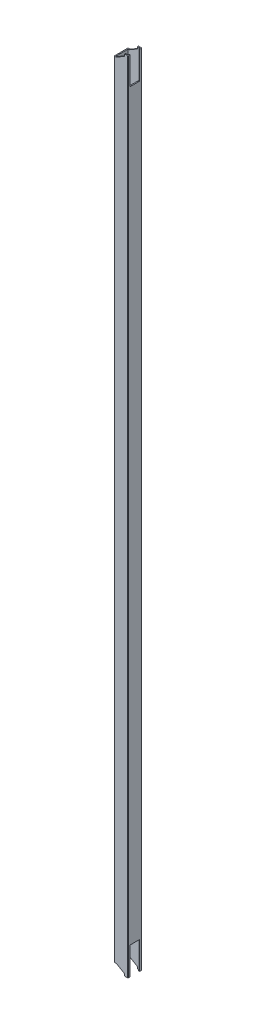
ISO-10303-21;
HEADER;
FILE_DESCRIPTION(('STEP AP214'),'2;1');
FILE_NAME('part.step','',(''),(''),'','','');
FILE_SCHEMA(('AUTOMOTIVE_DESIGN { 1 0 10303 214 1 1 1 1 }'));
ENDSEC;
DATA;
#1=APPLICATION_CONTEXT('core data for automotive mechanical design processes');
#2=APPLICATION_PROTOCOL_DEFINITION('international standard','automotive_design',2000,#1);
#3=PRODUCT_CONTEXT('',#1,'mechanical');
#4=PRODUCT('Part','Part','',(#3));
#5=PRODUCT_RELATED_PRODUCT_CATEGORY('part','',(#4));
#6=PRODUCT_DEFINITION_FORMATION('','',#4);
#7=PRODUCT_DEFINITION_CONTEXT('part definition',#1,'design');
#8=PRODUCT_DEFINITION('design','',#6,#7);
#9=PRODUCT_DEFINITION_SHAPE('','',#8);
#10=(LENGTH_UNIT() NAMED_UNIT(*) SI_UNIT(.MILLI.,.METRE.));
#11=(NAMED_UNIT(*) PLANE_ANGLE_UNIT() SI_UNIT($,.RADIAN.));
#12=(NAMED_UNIT(*) SI_UNIT($,.STERADIAN.) SOLID_ANGLE_UNIT());
#13=UNCERTAINTY_MEASURE_WITH_UNIT(LENGTH_MEASURE(1.E-05),#10,'distance_accuracy_value','');
#14=(GEOMETRIC_REPRESENTATION_CONTEXT(3) GLOBAL_UNCERTAINTY_ASSIGNED_CONTEXT((#13)) GLOBAL_UNIT_ASSIGNED_CONTEXT((#10,
#11,#12)) REPRESENTATION_CONTEXT('',''));
#15=CARTESIAN_POINT('',(0.,0.,0.));
#16=DIRECTION('',(0.,0.,1.));
#17=DIRECTION('',(1.,0.,0.));
#18=AXIS2_PLACEMENT_3D('',#15,#16,#17);
#19=CARTESIAN_POINT('',(19.5,0.,-0.5));
#20=DIRECTION('',(0.,1.,0.));
#21=DIRECTION('',(0.,0.,1.));
#22=AXIS2_PLACEMENT_3D('',#19,#20,#21);
#23=PLANE('',#22);
#24=DIRECTION('',(0.,0.,-1.));
#25=VECTOR('',#24,1.);
#26=CARTESIAN_POINT('',(15.,0.,0.));
#27=LINE('',#26,#25);
#28=CARTESIAN_POINT('',(15.,0.,-18.5));
#29=VERTEX_POINT('',#28);
#30=CARTESIAN_POINT('',(15.,0.,-20.));
#31=VERTEX_POINT('',#30);
#32=EDGE_CURVE('E284',#29,#31,#27,.T.);
#33=ORIENTED_EDGE('',*,*,#32,.T.);
#34=DIRECTION('',(-1.,0.,0.));
#35=VECTOR('',#34,1.);
#36=CARTESIAN_POINT('',(0.5,0.,-20.));
#37=LINE('',#36,#35);
#38=CARTESIAN_POINT('',(19.5,0.,-20.));
#39=VERTEX_POINT('',#38);
#40=EDGE_CURVE('E431',#39,#31,#37,.T.);
#41=ORIENTED_EDGE('',*,*,#40,.F.);
#42=CARTESIAN_POINT('',(19.5,0.,-19.5));
#43=DIRECTION('',(0.,1.,0.));
#44=DIRECTION('',(0.,0.,-1.));
#45=AXIS2_PLACEMENT_3D('',#42,#43,#44);
#46=CIRCLE('',#45,0.5);
#47=CARTESIAN_POINT('',(20.,0.,-19.5));
#48=VERTEX_POINT('',#47);
#49=EDGE_CURVE('E429',#48,#39,#46,.T.);
#50=ORIENTED_EDGE('',*,*,#49,.F.);
#51=DIRECTION('',(0.,0.,-1.));
#52=VECTOR('',#51,1.);
#53=CARTESIAN_POINT('',(20.,0.,-0.5));
#54=LINE('',#53,#52);
#55=CARTESIAN_POINT('',(20.,0.,-17.));
#56=VERTEX_POINT('',#55);
#57=EDGE_CURVE('E425',#56,#48,#54,.T.);
#58=ORIENTED_EDGE('',*,*,#57,.F.);
#59=DIRECTION('',(-1.,0.,0.));
#60=VECTOR('',#59,1.);
#61=CARTESIAN_POINT('',(19.5,0.,-17.));
#62=LINE('',#61,#60);
#63=CARTESIAN_POINT('',(18.5,0.,-17.));
#64=VERTEX_POINT('',#63);
#65=EDGE_CURVE('E474',#56,#64,#62,.T.);
#66=ORIENTED_EDGE('',*,*,#65,.T.);
#67=DIRECTION('',(0.,0.,-1.));
#68=VECTOR('',#67,1.);
#69=CARTESIAN_POINT('',(18.5,0.,-1.5));
#70=LINE('',#69,#68);
#71=CARTESIAN_POINT('',(18.5,0.,-18.5));
#72=VERTEX_POINT('',#71);
#73=EDGE_CURVE('E389',#64,#72,#70,.T.);
#74=ORIENTED_EDGE('',*,*,#73,.T.);
#75=DIRECTION('',(-1.,0.,0.));
#76=VECTOR('',#75,1.);
#77=CARTESIAN_POINT('',(1.5,0.,-18.5));
#78=LINE('',#77,#76);
#79=EDGE_CURVE('E380',#72,#29,#78,.T.);
#80=ORIENTED_EDGE('',*,*,#79,.T.);
#81=EDGE_LOOP('',(#33,#41,#50,#58,#66,#74,#80));
#82=FACE_BOUND('',#81,.T.);
#83=ADVANCED_FACE('F33',(#82),#23,.F.);
#84=CARTESIAN_POINT('',(15.,0.,0.));
#85=VERTEX_POINT('',#84);
#86=CARTESIAN_POINT('',(15.,0.,-1.5));
#87=VERTEX_POINT('',#86);
#88=EDGE_CURVE('E280',#85,#87,#27,.T.);
#89=ORIENTED_EDGE('',*,*,#88,.T.);
#90=DIRECTION('',(1.,0.,0.));
#91=VECTOR('',#90,1.);
#92=CARTESIAN_POINT('',(1.5,0.,-1.5));
#93=LINE('',#92,#91);
#94=CARTESIAN_POINT('',(18.5,0.,-1.5));
#95=VERTEX_POINT('',#94);
#96=EDGE_CURVE('E376',#87,#95,#93,.T.);
#97=ORIENTED_EDGE('',*,*,#96,.T.);
#98=CARTESIAN_POINT('',(18.5,0.,-3.));
#99=VERTEX_POINT('',#98);
#100=EDGE_CURVE('E390',#95,#99,#70,.T.);
#101=ORIENTED_EDGE('',*,*,#100,.T.);
#102=DIRECTION('',(1.,0.,0.));
#103=VECTOR('',#102,1.);
#104=CARTESIAN_POINT('',(19.5,0.,-3.));
#105=LINE('',#104,#103);
#106=CARTESIAN_POINT('',(20.,0.,-2.99999999999999));
#107=VERTEX_POINT('',#106);
#108=EDGE_CURVE('E472',#99,#107,#105,.T.);
#109=ORIENTED_EDGE('',*,*,#108,.T.);
#110=CARTESIAN_POINT('',(20.,0.,-0.5));
#111=VERTEX_POINT('',#110);
#112=EDGE_CURVE('E426',#111,#107,#54,.T.);
#113=ORIENTED_EDGE('',*,*,#112,.F.);
#114=CARTESIAN_POINT('',(19.5,0.,-0.5));
#115=DIRECTION('',(0.,1.,0.));
#116=DIRECTION('',(0.,0.,1.));
#117=AXIS2_PLACEMENT_3D('',#114,#115,#116);
#118=CIRCLE('',#117,0.5);
#119=CARTESIAN_POINT('',(19.5,0.,0.));
#120=VERTEX_POINT('',#119);
#121=EDGE_CURVE('E406',#120,#111,#118,.T.);
#122=ORIENTED_EDGE('',*,*,#121,.F.);
#123=DIRECTION('',(1.,0.,0.));
#124=VECTOR('',#123,1.);
#125=CARTESIAN_POINT('',(0.500000000000004,0.,0.));
#126=LINE('',#125,#124);
#127=EDGE_CURVE('E411',#85,#120,#126,.T.);
#128=ORIENTED_EDGE('',*,*,#127,.F.);
#129=EDGE_LOOP('',(#89,#97,#101,#109,#113,#122,#128));
#130=FACE_BOUND('',#129,.T.);
#131=ADVANCED_FACE('F552',(#130),#23,.F.);
#132=CARTESIAN_POINT('',(0.5,1156.4,-20.));
#133=DIRECTION('',(0.,0.,1.));
#134=DIRECTION('',(1.,0.,0.));
#135=AXIS2_PLACEMENT_3D('',#132,#133,#134);
#136=PLANE('',#135);
#137=DIRECTION('',(0.,1.,0.));
#138=VECTOR('',#137,1.);
#139=CARTESIAN_POINT('',(15.,0.,-20.));
#140=LINE('',#139,#138);
#141=CARTESIAN_POINT('',(15.,2.99999999999989,-20.));
#142=VERTEX_POINT('',#141);
#143=EDGE_CURVE('E267',#31,#142,#140,.T.);
#144=ORIENTED_EDGE('',*,*,#143,.T.);
#145=DIRECTION('',(-0.86377890089843,0.503871025524092,0.));
#146=VECTOR('',#145,1.);
#147=CARTESIAN_POINT('',(15.,2.99999999999989,-20.));
#148=LINE('',#147,#146);
#149=CARTESIAN_POINT('',(3.,10.,-20.));
#150=VERTEX_POINT('',#149);
#151=EDGE_CURVE('E270',#142,#150,#148,.T.);
#152=ORIENTED_EDGE('',*,*,#151,.T.);
#153=DIRECTION('',(-1.,0.,0.));
#154=VECTOR('',#153,1.);
#155=CARTESIAN_POINT('',(3.,10.,-20.));
#156=LINE('',#155,#154);
#157=CARTESIAN_POINT('',(0.5,10.,-20.));
#158=VERTEX_POINT('',#157);
#159=EDGE_CURVE('E275',#150,#158,#156,.T.);
#160=ORIENTED_EDGE('',*,*,#159,.T.);
#161=DIRECTION('',(0.,-1.,0.));
#162=VECTOR('',#161,1.);
#163=CARTESIAN_POINT('',(0.5,1156.4,-20.));
#164=LINE('',#163,#162);
#165=CARTESIAN_POINT('',(0.5,1146.4,-20.));
#166=VERTEX_POINT('',#165);
#167=EDGE_CURVE('E444',#166,#158,#164,.T.);
#168=ORIENTED_EDGE('',*,*,#167,.F.);
#169=DIRECTION('',(-1.,0.,0.));
#170=VECTOR('',#169,1.);
#171=CARTESIAN_POINT('',(3.,1146.4,-20.));
#172=LINE('',#171,#170);
#173=CARTESIAN_POINT('',(3.,1146.4,-20.));
#174=VERTEX_POINT('',#173);
#175=EDGE_CURVE('E319',#174,#166,#172,.T.);
#176=ORIENTED_EDGE('',*,*,#175,.F.);
#177=DIRECTION('',(-0.86377890089843,-0.503871025524092,0.));
#178=VECTOR('',#177,1.);
#179=CARTESIAN_POINT('',(15.,1153.4,-20.));
#180=LINE('',#179,#178);
#181=CARTESIAN_POINT('',(15.,1153.4,-20.));
#182=VERTEX_POINT('',#181);
#183=EDGE_CURVE('E327',#182,#174,#180,.T.);
#184=ORIENTED_EDGE('',*,*,#183,.F.);
#185=DIRECTION('',(0.,-1.,0.));
#186=VECTOR('',#185,1.);
#187=CARTESIAN_POINT('',(15.,1156.4,-20.));
#188=LINE('',#187,#186);
#189=CARTESIAN_POINT('',(15.,1156.4,-20.));
#190=VERTEX_POINT('',#189);
#191=EDGE_CURVE('E314',#190,#182,#188,.T.);
#192=ORIENTED_EDGE('',*,*,#191,.F.);
#193=DIRECTION('',(-1.,0.,0.));
#194=VECTOR('',#193,1.);
#195=CARTESIAN_POINT('',(0.5,1156.4,-20.));
#196=LINE('',#195,#194);
#197=CARTESIAN_POINT('',(19.5,1156.4,-20.));
#198=VERTEX_POINT('',#197);
#199=EDGE_CURVE('E417',#198,#190,#196,.T.);
#200=ORIENTED_EDGE('',*,*,#199,.F.);
#201=DIRECTION('',(0.,-1.,0.));
#202=VECTOR('',#201,1.);
#203=CARTESIAN_POINT('',(19.5,1156.4,-20.));
#204=LINE('',#203,#202);
#205=EDGE_CURVE('E447',#198,#39,#204,.T.);
#206=ORIENTED_EDGE('',*,*,#205,.T.);
#207=ORIENTED_EDGE('',*,*,#40,.T.);
#208=EDGE_LOOP('',(#144,#152,#160,#168,#176,#184,#192,#200,#206,#207));
#209=FACE_BOUND('',#208,.T.);
#210=ADVANCED_FACE('F496',(#209),#136,.F.);
#211=CARTESIAN_POINT('',(0.5,1156.4,-19.5));
#212=DIRECTION('',(0.,-1.,0.));
#213=DIRECTION('',(0.,0.,-1.));
#214=AXIS2_PLACEMENT_3D('',#211,#212,#213);
#215=CYLINDRICAL_SURFACE('',#214,0.5);
#216=CARTESIAN_POINT('',(0.5,10.,-19.5));
#217=DIRECTION('',(0.,-1.,0.));
#218=DIRECTION('',(0.,0.,-1.));
#219=AXIS2_PLACEMENT_3D('',#216,#217,#218);
#220=CIRCLE('',#219,0.5);
#221=CARTESIAN_POINT('',(0.,10.,-19.5));
#222=VERTEX_POINT('',#221);
#223=EDGE_CURVE('E292',#222,#158,#220,.T.);
#224=ORIENTED_EDGE('',*,*,#223,.F.);
#225=DIRECTION('',(0.,-1.,0.));
#226=VECTOR('',#225,1.);
#227=CARTESIAN_POINT('',(0.,1156.4,-19.5));
#228=LINE('',#227,#226);
#229=CARTESIAN_POINT('',(0.,1146.4,-19.5));
#230=VERTEX_POINT('',#229);
#231=EDGE_CURVE('E441',#230,#222,#228,.T.);
#232=ORIENTED_EDGE('',*,*,#231,.F.);
#233=CARTESIAN_POINT('',(0.5,1146.4,-19.5));
#234=DIRECTION('',(0.,-1.,0.));
#235=DIRECTION('',(0.,0.,-1.));
#236=AXIS2_PLACEMENT_3D('',#233,#234,#235);
#237=CIRCLE('',#236,0.5);
#238=EDGE_CURVE('E355',#230,#166,#237,.T.);
#239=ORIENTED_EDGE('',*,*,#238,.T.);
#240=ORIENTED_EDGE('',*,*,#167,.T.);
#241=EDGE_LOOP('',(#224,#232,#239,#240));
#242=FACE_BOUND('',#241,.T.);
#243=ADVANCED_FACE('F581',(#242),#215,.T.);
#244=CARTESIAN_POINT('',(0.,1156.4,-0.500000000000004));
#245=DIRECTION('',(1.,0.,0.));
#246=DIRECTION('',(0.,0.,-1.));
#247=AXIS2_PLACEMENT_3D('',#244,#245,#246);
#248=PLANE('',#247);
#249=DIRECTION('',(0.,0.,-1.));
#250=VECTOR('',#249,1.);
#251=CARTESIAN_POINT('',(0.,10.,0.));
#252=LINE('',#251,#250);
#253=CARTESIAN_POINT('',(0.,10.,-0.5));
#254=VERTEX_POINT('',#253);
#255=EDGE_CURVE('E274',#254,#222,#252,.T.);
#256=ORIENTED_EDGE('',*,*,#255,.F.);
#257=DIRECTION('',(0.,-1.,0.));
#258=VECTOR('',#257,1.);
#259=CARTESIAN_POINT('',(0.,1156.4,-0.500000000000003));
#260=LINE('',#259,#258);
#261=CARTESIAN_POINT('',(0.,1146.4,-0.5));
#262=VERTEX_POINT('',#261);
#263=EDGE_CURVE('E438',#262,#254,#260,.T.);
#264=ORIENTED_EDGE('',*,*,#263,.F.);
#265=DIRECTION('',(0.,0.,-1.));
#266=VECTOR('',#265,1.);
#267=CARTESIAN_POINT('',(0.,1146.4,0.));
#268=LINE('',#267,#266);
#269=EDGE_CURVE('E331',#262,#230,#268,.T.);
#270=ORIENTED_EDGE('',*,*,#269,.T.);
#271=ORIENTED_EDGE('',*,*,#231,.T.);
#272=EDGE_LOOP('',(#256,#264,#270,#271));
#273=FACE_BOUND('',#272,.T.);
#274=ADVANCED_FACE('F578',(#273),#248,.F.);
#275=CARTESIAN_POINT('',(0.5,1156.4,-0.5));
#276=DIRECTION('',(0.,-1.,0.));
#277=DIRECTION('',(0.,0.,-1.));
#278=AXIS2_PLACEMENT_3D('',#275,#276,#277);
#279=CYLINDRICAL_SURFACE('',#278,0.5);
#280=CARTESIAN_POINT('',(0.5,10.,-0.5));
#281=DIRECTION('',(0.,-1.,0.));
#282=DIRECTION('',(0.,0.,-1.));
#283=AXIS2_PLACEMENT_3D('',#280,#281,#282);
#284=CIRCLE('',#283,0.5);
#285=CARTESIAN_POINT('',(0.500000000000003,10.,0.));
#286=VERTEX_POINT('',#285);
#287=EDGE_CURVE('E290',#286,#254,#284,.T.);
#288=ORIENTED_EDGE('',*,*,#287,.F.);
#289=DIRECTION('',(0.,-1.,0.));
#290=VECTOR('',#289,1.);
#291=CARTESIAN_POINT('',(0.500000000000004,1156.4,0.));
#292=LINE('',#291,#290);
#293=CARTESIAN_POINT('',(0.500000000000003,1146.4,0.));
#294=VERTEX_POINT('',#293);
#295=EDGE_CURVE('E266',#294,#286,#292,.T.);
#296=ORIENTED_EDGE('',*,*,#295,.F.);
#297=CARTESIAN_POINT('',(0.5,1146.4,-0.5));
#298=DIRECTION('',(0.,-1.,0.));
#299=DIRECTION('',(0.,0.,-1.));
#300=AXIS2_PLACEMENT_3D('',#297,#298,#299);
#301=CIRCLE('',#300,0.5);
#302=EDGE_CURVE('E352',#294,#262,#301,.T.);
#303=ORIENTED_EDGE('',*,*,#302,.T.);
#304=ORIENTED_EDGE('',*,*,#263,.T.);
#305=EDGE_LOOP('',(#288,#296,#303,#304));
#306=FACE_BOUND('',#305,.T.);
#307=ADVANCED_FACE('F573',(#306),#279,.T.);
#308=CARTESIAN_POINT('',(0.500000000000004,1156.4,0.));
#309=DIRECTION('',(0.,0.,-1.));
#310=DIRECTION('',(-1.,0.,0.));
#311=AXIS2_PLACEMENT_3D('',#308,#309,#310);
#312=PLANE('',#311);
#313=DIRECTION('',(0.,1.,0.));
#314=VECTOR('',#313,1.);
#315=CARTESIAN_POINT('',(15.,0.,0.));
#316=LINE('',#315,#314);
#317=CARTESIAN_POINT('',(15.,2.99999999999989,0.));
#318=VERTEX_POINT('',#317);
#319=EDGE_CURVE('E253',#85,#318,#316,.T.);
#320=ORIENTED_EDGE('',*,*,#319,.F.);
#321=ORIENTED_EDGE('',*,*,#127,.T.);
#322=DIRECTION('',(0.,-1.,0.));
#323=VECTOR('',#322,1.);
#324=CARTESIAN_POINT('',(19.5,1156.4,0.));
#325=LINE('',#324,#323);
#326=CARTESIAN_POINT('',(19.5,1156.4,0.));
#327=VERTEX_POINT('',#326);
#328=EDGE_CURVE('E422',#327,#120,#325,.T.);
#329=ORIENTED_EDGE('',*,*,#328,.F.);
#330=DIRECTION('',(1.,0.,0.));
#331=VECTOR('',#330,1.);
#332=CARTESIAN_POINT('',(0.500000000000004,1156.4,0.));
#333=LINE('',#332,#331);
#334=CARTESIAN_POINT('',(15.,1156.4,0.));
#335=VERTEX_POINT('',#334);
#336=EDGE_CURVE('E420',#335,#327,#333,.T.);
#337=ORIENTED_EDGE('',*,*,#336,.F.);
#338=DIRECTION('',(0.,-1.,0.));
#339=VECTOR('',#338,1.);
#340=CARTESIAN_POINT('',(15.,1156.4,0.));
#341=LINE('',#340,#339);
#342=CARTESIAN_POINT('',(15.,1153.4,0.));
#343=VERTEX_POINT('',#342);
#344=EDGE_CURVE('E315',#335,#343,#341,.T.);
#345=ORIENTED_EDGE('',*,*,#344,.T.);
#346=DIRECTION('',(-0.86377890089843,-0.503871025524092,0.));
#347=VECTOR('',#346,1.);
#348=CARTESIAN_POINT('',(15.,1153.4,0.));
#349=LINE('',#348,#347);
#350=CARTESIAN_POINT('',(3.,1146.4,0.));
#351=VERTEX_POINT('',#350);
#352=EDGE_CURVE('E318',#343,#351,#349,.T.);
#353=ORIENTED_EDGE('',*,*,#352,.T.);
#354=DIRECTION('',(-1.,0.,0.));
#355=VECTOR('',#354,1.);
#356=CARTESIAN_POINT('',(3.,1146.4,0.));
#357=LINE('',#356,#355);
#358=EDGE_CURVE('E322',#351,#294,#357,.T.);
#359=ORIENTED_EDGE('',*,*,#358,.T.);
#360=ORIENTED_EDGE('',*,*,#295,.T.);
#361=DIRECTION('',(-1.,0.,0.));
#362=VECTOR('',#361,1.);
#363=CARTESIAN_POINT('',(3.,10.,0.));
#364=LINE('',#363,#362);
#365=CARTESIAN_POINT('',(3.,10.,0.));
#366=VERTEX_POINT('',#365);
#367=EDGE_CURVE('E254',#366,#286,#364,.T.);
#368=ORIENTED_EDGE('',*,*,#367,.F.);
#369=DIRECTION('',(-0.86377890089843,0.503871025524092,0.));
#370=VECTOR('',#369,1.);
#371=CARTESIAN_POINT('',(15.,2.99999999999989,0.));
#372=LINE('',#371,#370);
#373=EDGE_CURVE('E243',#318,#366,#372,.T.);
#374=ORIENTED_EDGE('',*,*,#373,.F.);
#375=EDGE_LOOP('',(#320,#321,#329,#337,#345,#353,#359,#360,#368,#374));
#376=FACE_BOUND('',#375,.T.);
#377=ADVANCED_FACE('F263',(#376),#312,.F.);
#378=CARTESIAN_POINT('',(1.5,1156.4,-1.5));
#379=DIRECTION('',(1.,0.,0.));
#380=DIRECTION('',(0.,0.,-1.));
#381=AXIS2_PLACEMENT_3D('',#378,#379,#380);
#382=PLANE('',#381);
#383=DIRECTION('',(0.,-1.,0.));
#384=VECTOR('',#383,1.);
#385=CARTESIAN_POINT('',(1.5,1156.4,-1.5));
#386=LINE('',#385,#384);
#387=CARTESIAN_POINT('',(1.5,1146.4,-1.5));
#388=VERTEX_POINT('',#387);
#389=CARTESIAN_POINT('',(1.5,10.,-1.5));
#390=VERTEX_POINT('',#389);
#391=EDGE_CURVE('E403',#388,#390,#386,.T.);
#392=ORIENTED_EDGE('',*,*,#391,.T.);
#393=DIRECTION('',(0.,0.,-1.));
#394=VECTOR('',#393,1.);
#395=CARTESIAN_POINT('',(1.5,10.,-1.5));
#396=LINE('',#395,#394);
#397=CARTESIAN_POINT('',(1.5,10.,-18.5));
#398=VERTEX_POINT('',#397);
#399=EDGE_CURVE('E283',#390,#398,#396,.T.);
#400=ORIENTED_EDGE('',*,*,#399,.T.);
#401=DIRECTION('',(0.,-1.,0.));
#402=VECTOR('',#401,1.);
#403=CARTESIAN_POINT('',(1.5,1156.4,-18.5));
#404=LINE('',#403,#402);
#405=CARTESIAN_POINT('',(1.5,1146.4,-18.5));
#406=VERTEX_POINT('',#405);
#407=EDGE_CURVE('E387',#406,#398,#404,.T.);
#408=ORIENTED_EDGE('',*,*,#407,.F.);
#409=DIRECTION('',(0.,0.,-1.));
#410=VECTOR('',#409,1.);
#411=CARTESIAN_POINT('',(1.5,1146.4,-1.5));
#412=LINE('',#411,#410);
#413=EDGE_CURVE('E348',#388,#406,#412,.T.);
#414=ORIENTED_EDGE('',*,*,#413,.F.);
#415=EDGE_LOOP('',(#392,#400,#408,#414));
#416=FACE_BOUND('',#415,.T.);
#417=ADVANCED_FACE('F540',(#416),#382,.T.);
#418=CARTESIAN_POINT('',(1.5,1156.4,-1.5));
#419=DIRECTION('',(0.,0.,-1.));
#420=DIRECTION('',(-1.,0.,0.));
#421=AXIS2_PLACEMENT_3D('',#418,#419,#420);
#422=PLANE('',#421);
#423=ORIENTED_EDGE('',*,*,#96,.F.);
#424=DIRECTION('',(0.,1.,0.));
#425=VECTOR('',#424,1.);
#426=CARTESIAN_POINT('',(15.,1156.4,-1.5));
#427=LINE('',#426,#425);
#428=CARTESIAN_POINT('',(15.,2.99999999999989,-1.5));
#429=VERTEX_POINT('',#428);
#430=EDGE_CURVE('E296',#87,#429,#427,.T.);
#431=ORIENTED_EDGE('',*,*,#430,.T.);
#432=DIRECTION('',(-0.86377890089843,0.503871025524092,0.));
#433=VECTOR('',#432,1.);
#434=CARTESIAN_POINT('',(-497.070466321248,301.707772020733,-1.5));
#435=LINE('',#434,#433);
#436=CARTESIAN_POINT('',(3.,10.,-1.5));
#437=VERTEX_POINT('',#436);
#438=EDGE_CURVE('E294',#429,#437,#435,.T.);
#439=ORIENTED_EDGE('',*,*,#438,.T.);
#440=DIRECTION('',(-1.,0.,0.));
#441=VECTOR('',#440,1.);
#442=CARTESIAN_POINT('',(1.5,10.,-1.5));
#443=LINE('',#442,#441);
#444=EDGE_CURVE('E259',#437,#390,#443,.T.);
#445=ORIENTED_EDGE('',*,*,#444,.T.);
#446=ORIENTED_EDGE('',*,*,#391,.F.);
#447=DIRECTION('',(-1.,0.,0.));
#448=VECTOR('',#447,1.);
#449=CARTESIAN_POINT('',(1.5,1146.4,-1.5));
#450=LINE('',#449,#448);
#451=CARTESIAN_POINT('',(3.,1146.4,-1.5));
#452=VERTEX_POINT('',#451);
#453=EDGE_CURVE('E350',#452,#388,#450,.T.);
#454=ORIENTED_EDGE('',*,*,#453,.F.);
#455=DIRECTION('',(-0.86377890089843,-0.503871025524092,0.));
#456=VECTOR('',#455,1.);
#457=CARTESIAN_POINT('',(6.23316062176171,1148.28601036269,-1.5));
#458=LINE('',#457,#456);
#459=CARTESIAN_POINT('',(15.,1153.4,-1.5));
#460=VERTEX_POINT('',#459);
#461=EDGE_CURVE('E346',#460,#452,#458,.T.);
#462=ORIENTED_EDGE('',*,*,#461,.F.);
#463=DIRECTION('',(0.,-1.,0.));
#464=VECTOR('',#463,1.);
#465=CARTESIAN_POINT('',(15.,1156.4,-1.5));
#466=LINE('',#465,#464);
#467=CARTESIAN_POINT('',(15.,1156.4,-1.5));
#468=VERTEX_POINT('',#467);
#469=EDGE_CURVE('E334',#468,#460,#466,.T.);
#470=ORIENTED_EDGE('',*,*,#469,.F.);
#471=DIRECTION('',(1.,0.,0.));
#472=VECTOR('',#471,1.);
#473=CARTESIAN_POINT('',(1.5,1156.4,-1.5));
#474=LINE('',#473,#472);
#475=CARTESIAN_POINT('',(18.5,1156.4,-1.5));
#476=VERTEX_POINT('',#475);
#477=EDGE_CURVE('E377',#468,#476,#474,.T.);
#478=ORIENTED_EDGE('',*,*,#477,.T.);
#479=DIRECTION('',(0.,-1.,0.));
#480=VECTOR('',#479,1.);
#481=CARTESIAN_POINT('',(18.5,1156.4,-1.5));
#482=LINE('',#481,#480);
#483=EDGE_CURVE('E400',#476,#95,#482,.T.);
#484=ORIENTED_EDGE('',*,*,#483,.T.);
#485=EDGE_LOOP('',(#423,#431,#439,#445,#446,#454,#462,#470,#478,#484));
#486=FACE_BOUND('',#485,.T.);
#487=ADVANCED_FACE('F544',(#486),#422,.T.);
#488=CARTESIAN_POINT('',(1.5,1156.4,-18.5));
#489=DIRECTION('',(0.,0.,1.));
#490=DIRECTION('',(1.,0.,0.));
#491=AXIS2_PLACEMENT_3D('',#488,#489,#490);
#492=PLANE('',#491);
#493=DIRECTION('',(0.86377890089843,-0.503871025524092,0.));
#494=VECTOR('',#493,1.);
#495=CARTESIAN_POINT('',(-497.070466321248,301.707772020733,-18.5));
#496=LINE('',#495,#494);
#497=CARTESIAN_POINT('',(3.,10.,-18.5));
#498=VERTEX_POINT('',#497);
#499=CARTESIAN_POINT('',(15.,2.99999999999989,-18.5));
#500=VERTEX_POINT('',#499);
#501=EDGE_CURVE('E41',#498,#500,#496,.T.);
#502=ORIENTED_EDGE('',*,*,#501,.T.);
#503=DIRECTION('',(0.,-1.,0.));
#504=VECTOR('',#503,1.);
#505=CARTESIAN_POINT('',(15.,1156.4,-18.5));
#506=LINE('',#505,#504);
#507=EDGE_CURVE('E11',#500,#29,#506,.T.);
#508=ORIENTED_EDGE('',*,*,#507,.T.);
#509=ORIENTED_EDGE('',*,*,#79,.F.);
#510=DIRECTION('',(0.,-1.,0.));
#511=VECTOR('',#510,1.);
#512=CARTESIAN_POINT('',(18.5,1156.4,-18.5));
#513=LINE('',#512,#511);
#514=CARTESIAN_POINT('',(18.5,1156.4,-18.5));
#515=VERTEX_POINT('',#514);
#516=EDGE_CURVE('E397',#515,#72,#513,.T.);
#517=ORIENTED_EDGE('',*,*,#516,.F.);
#518=DIRECTION('',(-1.,0.,0.));
#519=VECTOR('',#518,1.);
#520=CARTESIAN_POINT('',(1.5,1156.4,-18.5));
#521=LINE('',#520,#519);
#522=CARTESIAN_POINT('',(15.,1156.4,-18.5));
#523=VERTEX_POINT('',#522);
#524=EDGE_CURVE('E384',#515,#523,#521,.T.);
#525=ORIENTED_EDGE('',*,*,#524,.T.);
#526=DIRECTION('',(0.,1.,0.));
#527=VECTOR('',#526,1.);
#528=CARTESIAN_POINT('',(15.,1156.4,-18.5));
#529=LINE('',#528,#527);
#530=CARTESIAN_POINT('',(15.,1153.4,-18.5));
#531=VERTEX_POINT('',#530);
#532=EDGE_CURVE('E465',#531,#523,#529,.T.);
#533=ORIENTED_EDGE('',*,*,#532,.F.);
#534=DIRECTION('',(0.86377890089843,0.503871025524092,0.));
#535=VECTOR('',#534,1.);
#536=CARTESIAN_POINT('',(6.23316062176171,1148.28601036269,-18.5));
#537=LINE('',#536,#535);
#538=CARTESIAN_POINT('',(3.,1146.4,-18.5));
#539=VERTEX_POINT('',#538);
#540=EDGE_CURVE('E467',#539,#531,#537,.T.);
#541=ORIENTED_EDGE('',*,*,#540,.F.);
#542=DIRECTION('',(1.,0.,0.));
#543=VECTOR('',#542,1.);
#544=CARTESIAN_POINT('',(1.5,1146.4,-18.5));
#545=LINE('',#544,#543);
#546=EDGE_CURVE('E470',#406,#539,#545,.T.);
#547=ORIENTED_EDGE('',*,*,#546,.F.);
#548=ORIENTED_EDGE('',*,*,#407,.T.);
#549=DIRECTION('',(1.,0.,0.));
#550=VECTOR('',#549,1.);
#551=CARTESIAN_POINT('',(1.5,10.,-18.5));
#552=LINE('',#551,#550);
#553=EDGE_CURVE('E479',#398,#498,#552,.T.);
#554=ORIENTED_EDGE('',*,*,#553,.T.);
#555=EDGE_LOOP('',(#502,#508,#509,#517,#525,#533,#541,#547,#548,#554));
#556=FACE_BOUND('',#555,.T.);
#557=ADVANCED_FACE('F483',(#556),#492,.T.);
#558=CARTESIAN_POINT('',(19.5,1156.4,-0.5));
#559=DIRECTION('',(0.,1.,0.));
#560=DIRECTION('',(0.,0.,1.));
#561=AXIS2_PLACEMENT_3D('',#558,#559,#560);
#562=PLANE('',#561);
#563=DIRECTION('',(0.,0.,-1.));
#564=VECTOR('',#563,1.);
#565=CARTESIAN_POINT('',(15.,1156.4,0.));
#566=LINE('',#565,#564);
#567=EDGE_CURVE('E343',#335,#468,#566,.T.);
#568=ORIENTED_EDGE('',*,*,#567,.F.);
#569=ORIENTED_EDGE('',*,*,#336,.T.);
#570=CARTESIAN_POINT('',(19.5,1156.4,-0.5));
#571=DIRECTION('',(0.,1.,0.));
#572=DIRECTION('',(0.,0.,1.));
#573=AXIS2_PLACEMENT_3D('',#570,#571,#572);
#574=CIRCLE('',#573,0.5);
#575=CARTESIAN_POINT('',(20.,1156.4,-0.5));
#576=VERTEX_POINT('',#575);
#577=EDGE_CURVE('E407',#327,#576,#574,.T.);
#578=ORIENTED_EDGE('',*,*,#577,.T.);
#579=DIRECTION('',(0.,0.,-1.));
#580=VECTOR('',#579,1.);
#581=CARTESIAN_POINT('',(20.,1156.4,-0.5));
#582=LINE('',#581,#580);
#583=CARTESIAN_POINT('',(20.,1156.4,-3.));
#584=VERTEX_POINT('',#583);
#585=EDGE_CURVE('E412',#576,#584,#582,.T.);
#586=ORIENTED_EDGE('',*,*,#585,.T.);
#587=DIRECTION('',(1.,0.,0.));
#588=VECTOR('',#587,1.);
#589=CARTESIAN_POINT('',(10.,1156.4,-3.));
#590=LINE('',#589,#588);
#591=CARTESIAN_POINT('',(18.5,1156.4,-3.));
#592=VERTEX_POINT('',#591);
#593=EDGE_CURVE('E370',#592,#584,#590,.T.);
#594=ORIENTED_EDGE('',*,*,#593,.F.);
#595=DIRECTION('',(0.,0.,-1.));
#596=VECTOR('',#595,1.);
#597=CARTESIAN_POINT('',(18.5,1156.4,-1.5));
#598=LINE('',#597,#596);
#599=EDGE_CURVE('E381',#476,#592,#598,.T.);
#600=ORIENTED_EDGE('',*,*,#599,.F.);
#601=ORIENTED_EDGE('',*,*,#477,.F.);
#602=EDGE_LOOP('',(#568,#569,#578,#586,#594,#600,#601));
#603=FACE_BOUND('',#602,.T.);
#604=ADVANCED_FACE('F559',(#603),#562,.T.);
#605=EDGE_CURVE('E324',#523,#190,#566,.T.);
#606=ORIENTED_EDGE('',*,*,#605,.F.);
#607=ORIENTED_EDGE('',*,*,#524,.F.);
#608=CARTESIAN_POINT('',(18.5,1156.4,-17.));
#609=VERTEX_POINT('',#608);
#610=EDGE_CURVE('E379',#609,#515,#598,.T.);
#611=ORIENTED_EDGE('',*,*,#610,.F.);
#612=DIRECTION('',(1.,0.,0.));
#613=VECTOR('',#612,1.);
#614=CARTESIAN_POINT('',(10.,1156.4,-17.));
#615=LINE('',#614,#613);
#616=CARTESIAN_POINT('',(20.,1156.4,-17.));
#617=VERTEX_POINT('',#616);
#618=EDGE_CURVE('E367',#609,#617,#615,.T.);
#619=ORIENTED_EDGE('',*,*,#618,.T.);
#620=CARTESIAN_POINT('',(20.,1156.4,-19.5));
#621=VERTEX_POINT('',#620);
#622=EDGE_CURVE('E410',#617,#621,#582,.T.);
#623=ORIENTED_EDGE('',*,*,#622,.T.);
#624=CARTESIAN_POINT('',(19.5,1156.4,-19.5));
#625=DIRECTION('',(0.,1.,0.));
#626=DIRECTION('',(0.,0.,-1.));
#627=AXIS2_PLACEMENT_3D('',#624,#625,#626);
#628=CIRCLE('',#627,0.5);
#629=EDGE_CURVE('E415',#621,#198,#628,.T.);
#630=ORIENTED_EDGE('',*,*,#629,.T.);
#631=ORIENTED_EDGE('',*,*,#199,.T.);
#632=EDGE_LOOP('',(#606,#607,#611,#619,#623,#630,#631));
#633=FACE_BOUND('',#632,.T.);
#634=ADVANCED_FACE('F525',(#633),#562,.T.);
#635=CARTESIAN_POINT('',(20.,1156.4,-0.5));
#636=DIRECTION('',(-1.,0.,0.));
#637=DIRECTION('',(0.,0.,1.));
#638=AXIS2_PLACEMENT_3D('',#635,#636,#637);
#639=PLANE('',#638);
#640=DIRECTION('',(0.,0.,1.));
#641=VECTOR('',#640,1.);
#642=CARTESIAN_POINT('',(20.,40.,-17.));
#643=LINE('',#642,#641);
#644=CARTESIAN_POINT('',(20.,40.,-17.));
#645=VERTEX_POINT('',#644);
#646=CARTESIAN_POINT('',(20.,40.,-2.99999999999999));
#647=VERTEX_POINT('',#646);
#648=EDGE_CURVE('E303',#645,#647,#643,.T.);
#649=ORIENTED_EDGE('',*,*,#648,.F.);
#650=DIRECTION('',(0.,1.,0.));
#651=VECTOR('',#650,1.);
#652=CARTESIAN_POINT('',(20.,0.,-17.));
#653=LINE('',#652,#651);
#654=EDGE_CURVE('E299',#56,#645,#653,.T.);
#655=ORIENTED_EDGE('',*,*,#654,.F.);
#656=ORIENTED_EDGE('',*,*,#57,.T.);
#657=DIRECTION('',(0.,-1.,0.));
#658=VECTOR('',#657,1.);
#659=CARTESIAN_POINT('',(20.,1156.4,-19.5));
#660=LINE('',#659,#658);
#661=EDGE_CURVE('E450',#621,#48,#660,.T.);
#662=ORIENTED_EDGE('',*,*,#661,.F.);
#663=ORIENTED_EDGE('',*,*,#622,.F.);
#664=DIRECTION('',(0.,-1.,0.));
#665=VECTOR('',#664,1.);
#666=CARTESIAN_POINT('',(20.,1156.4,-17.));
#667=LINE('',#666,#665);
#668=CARTESIAN_POINT('',(20.,1116.4,-17.));
#669=VERTEX_POINT('',#668);
#670=EDGE_CURVE('E358',#617,#669,#667,.T.);
#671=ORIENTED_EDGE('',*,*,#670,.T.);
#672=DIRECTION('',(0.,0.,1.));
#673=VECTOR('',#672,1.);
#674=CARTESIAN_POINT('',(20.,1116.4,-17.));
#675=LINE('',#674,#673);
#676=CARTESIAN_POINT('',(20.,1116.4,-2.99999999999999));
#677=VERTEX_POINT('',#676);
#678=EDGE_CURVE('E361',#669,#677,#675,.T.);
#679=ORIENTED_EDGE('',*,*,#678,.T.);
#680=DIRECTION('',(0.,1.,0.));
#681=VECTOR('',#680,1.);
#682=CARTESIAN_POINT('',(20.,1156.4,-3.));
#683=LINE('',#682,#681);
#684=EDGE_CURVE('E364',#677,#584,#683,.T.);
#685=ORIENTED_EDGE('',*,*,#684,.T.);
#686=ORIENTED_EDGE('',*,*,#585,.F.);
#687=DIRECTION('',(0.,-1.,0.));
#688=VECTOR('',#687,1.);
#689=CARTESIAN_POINT('',(20.,1156.4,-0.5));
#690=LINE('',#689,#688);
#691=EDGE_CURVE('E453',#576,#111,#690,.T.);
#692=ORIENTED_EDGE('',*,*,#691,.T.);
#693=ORIENTED_EDGE('',*,*,#112,.T.);
#694=DIRECTION('',(0.,-1.,0.));
#695=VECTOR('',#694,1.);
#696=CARTESIAN_POINT('',(20.,0.,-3.));
#697=LINE('',#696,#695);
#698=EDGE_CURVE('E56',#647,#107,#697,.T.);
#699=ORIENTED_EDGE('',*,*,#698,.F.);
#700=EDGE_LOOP('',(#649,#655,#656,#662,#663,#671,#679,#685,#686,#692,#693,#699));
#701=FACE_BOUND('',#700,.T.);
#702=ADVANCED_FACE('F509',(#701),#639,.F.);
#703=CARTESIAN_POINT('',(18.5,1156.4,-1.5));
#704=DIRECTION('',(-1.,0.,0.));
#705=DIRECTION('',(0.,0.,1.));
#706=AXIS2_PLACEMENT_3D('',#703,#704,#705);
#707=PLANE('',#706);
#708=DIRECTION('',(0.,-1.,0.));
#709=VECTOR('',#708,1.);
#710=CARTESIAN_POINT('',(18.5,1156.4,-16.9999999999999));
#711=LINE('',#710,#709);
#712=CARTESIAN_POINT('',(18.5,40.,-17.));
#713=VERTEX_POINT('',#712);
#714=EDGE_CURVE('E312',#713,#64,#711,.T.);
#715=ORIENTED_EDGE('',*,*,#714,.F.);
#716=DIRECTION('',(0.,0.,-1.));
#717=VECTOR('',#716,1.);
#718=CARTESIAN_POINT('',(18.5,40.,-1.5));
#719=LINE('',#718,#717);
#720=CARTESIAN_POINT('',(18.5,40.,-2.99999999999999));
#721=VERTEX_POINT('',#720);
#722=EDGE_CURVE('E477',#721,#713,#719,.T.);
#723=ORIENTED_EDGE('',*,*,#722,.F.);
#724=DIRECTION('',(0.,1.,0.));
#725=VECTOR('',#724,1.);
#726=CARTESIAN_POINT('',(18.5,1156.4,-2.99999999999969));
#727=LINE('',#726,#725);
#728=EDGE_CURVE('E310',#99,#721,#727,.T.);
#729=ORIENTED_EDGE('',*,*,#728,.F.);
#730=ORIENTED_EDGE('',*,*,#100,.F.);
#731=ORIENTED_EDGE('',*,*,#483,.F.);
#732=ORIENTED_EDGE('',*,*,#599,.T.);
#733=DIRECTION('',(0.,-1.,0.));
#734=VECTOR('',#733,1.);
#735=CARTESIAN_POINT('',(18.5,1156.4,-3.));
#736=LINE('',#735,#734);
#737=CARTESIAN_POINT('',(18.5,1116.4,-2.99999999999999));
#738=VERTEX_POINT('',#737);
#739=EDGE_CURVE('E456',#592,#738,#736,.T.);
#740=ORIENTED_EDGE('',*,*,#739,.T.);
#741=DIRECTION('',(0.,0.,-1.));
#742=VECTOR('',#741,1.);
#743=CARTESIAN_POINT('',(18.5,1116.4,-1.5));
#744=LINE('',#743,#742);
#745=CARTESIAN_POINT('',(18.5,1116.4,-17.));
#746=VERTEX_POINT('',#745);
#747=EDGE_CURVE('E459',#738,#746,#744,.T.);
#748=ORIENTED_EDGE('',*,*,#747,.T.);
#749=DIRECTION('',(0.,1.,0.));
#750=VECTOR('',#749,1.);
#751=CARTESIAN_POINT('',(18.5,1156.4,-17.));
#752=LINE('',#751,#750);
#753=EDGE_CURVE('E462',#746,#609,#752,.T.);
#754=ORIENTED_EDGE('',*,*,#753,.T.);
#755=ORIENTED_EDGE('',*,*,#610,.T.);
#756=ORIENTED_EDGE('',*,*,#516,.T.);
#757=ORIENTED_EDGE('',*,*,#73,.F.);
#758=EDGE_LOOP('',(#715,#723,#729,#730,#731,#732,#740,#748,#754,#755,#756,#757));
#759=FACE_BOUND('',#758,.T.);
#760=ADVANCED_FACE('F517',(#759),#707,.T.);
#761=CARTESIAN_POINT('',(19.5,1156.4,-0.5));
#762=DIRECTION('',(0.,-1.,0.));
#763=DIRECTION('',(0.,0.,-1.));
#764=AXIS2_PLACEMENT_3D('',#761,#762,#763);
#765=CYLINDRICAL_SURFACE('',#764,0.5);
#766=ORIENTED_EDGE('',*,*,#121,.T.);
#767=ORIENTED_EDGE('',*,*,#691,.F.);
#768=ORIENTED_EDGE('',*,*,#577,.F.);
#769=ORIENTED_EDGE('',*,*,#328,.T.);
#770=EDGE_LOOP('',(#766,#767,#768,#769));
#771=FACE_BOUND('',#770,.T.);
#772=ADVANCED_FACE('F35',(#771),#765,.T.);
#773=CARTESIAN_POINT('',(19.5,1156.4,-19.5));
#774=DIRECTION('',(0.,-1.,0.));
#775=DIRECTION('',(0.,0.,-1.));
#776=AXIS2_PLACEMENT_3D('',#773,#774,#775);
#777=CYLINDRICAL_SURFACE('',#776,0.5);
#778=ORIENTED_EDGE('',*,*,#49,.T.);
#779=ORIENTED_EDGE('',*,*,#205,.F.);
#780=ORIENTED_EDGE('',*,*,#629,.F.);
#781=ORIENTED_EDGE('',*,*,#661,.T.);
#782=EDGE_LOOP('',(#778,#779,#780,#781));
#783=FACE_BOUND('',#782,.T.);
#784=ADVANCED_FACE('F502',(#783),#777,.T.);
#785=CARTESIAN_POINT('',(10.,1156.4,-17.));
#786=DIRECTION('',(0.,0.,1.));
#787=DIRECTION('',(0.,-1.,0.));
#788=AXIS2_PLACEMENT_3D('',#785,#786,#787);
#789=PLANE('',#788);
#790=DIRECTION('',(1.,0.,0.));
#791=VECTOR('',#790,1.);
#792=CARTESIAN_POINT('',(10.,1116.4,-17.));
#793=LINE('',#792,#791);
#794=EDGE_CURVE('E374',#746,#669,#793,.T.);
#795=ORIENTED_EDGE('',*,*,#794,.T.);
#796=ORIENTED_EDGE('',*,*,#670,.F.);
#797=ORIENTED_EDGE('',*,*,#618,.F.);
#798=ORIENTED_EDGE('',*,*,#753,.F.);
#799=EDGE_LOOP('',(#795,#796,#797,#798));
#800=FACE_BOUND('',#799,.T.);
#801=ADVANCED_FACE('F661',(#800),#789,.T.);
#802=CARTESIAN_POINT('',(10.,1116.4,-17.));
#803=DIRECTION('',(0.,1.,0.));
#804=DIRECTION('',(0.,0.,1.));
#805=AXIS2_PLACEMENT_3D('',#802,#803,#804);
#806=PLANE('',#805);
#807=DIRECTION('',(1.,0.,0.));
#808=VECTOR('',#807,1.);
#809=CARTESIAN_POINT('',(10.,1116.4,-2.99999999999999));
#810=LINE('',#809,#808);
#811=EDGE_CURVE('E372',#738,#677,#810,.T.);
#812=ORIENTED_EDGE('',*,*,#811,.T.);
#813=ORIENTED_EDGE('',*,*,#678,.F.);
#814=ORIENTED_EDGE('',*,*,#794,.F.);
#815=ORIENTED_EDGE('',*,*,#747,.F.);
#816=EDGE_LOOP('',(#812,#813,#814,#815));
#817=FACE_BOUND('',#816,.T.);
#818=ADVANCED_FACE('F668',(#817),#806,.T.);
#819=CARTESIAN_POINT('',(10.,1156.4,-3.));
#820=DIRECTION('',(0.,0.,-1.));
#821=DIRECTION('',(0.,1.,0.));
#822=AXIS2_PLACEMENT_3D('',#819,#820,#821);
#823=PLANE('',#822);
#824=ORIENTED_EDGE('',*,*,#593,.T.);
#825=ORIENTED_EDGE('',*,*,#684,.F.);
#826=ORIENTED_EDGE('',*,*,#811,.F.);
#827=ORIENTED_EDGE('',*,*,#739,.F.);
#828=EDGE_LOOP('',(#824,#825,#826,#827));
#829=FACE_BOUND('',#828,.T.);
#830=ADVANCED_FACE('F676',(#829),#823,.T.);
#831=CARTESIAN_POINT('',(3.,1146.4,0.));
#832=DIRECTION('',(0.,-1.,0.));
#833=DIRECTION('',(0.,0.,-1.));
#834=AXIS2_PLACEMENT_3D('',#831,#832,#833);
#835=PLANE('',#834);
#836=ORIENTED_EDGE('',*,*,#269,.F.);
#837=ORIENTED_EDGE('',*,*,#302,.F.);
#838=ORIENTED_EDGE('',*,*,#358,.F.);
#839=DIRECTION('',(0.,0.,-1.));
#840=VECTOR('',#839,1.);
#841=CARTESIAN_POINT('',(3.,1146.4,0.));
#842=LINE('',#841,#840);
#843=EDGE_CURVE('E335',#351,#452,#842,.T.);
#844=ORIENTED_EDGE('',*,*,#843,.T.);
#845=ORIENTED_EDGE('',*,*,#453,.T.);
#846=ORIENTED_EDGE('',*,*,#413,.T.);
#847=ORIENTED_EDGE('',*,*,#546,.T.);
#848=EDGE_CURVE('E338',#539,#174,#842,.T.);
#849=ORIENTED_EDGE('',*,*,#848,.T.);
#850=ORIENTED_EDGE('',*,*,#175,.T.);
#851=ORIENTED_EDGE('',*,*,#238,.F.);
#852=EDGE_LOOP('',(#836,#837,#838,#844,#845,#846,#847,#849,#850,#851));
#853=FACE_BOUND('',#852,.T.);
#854=ADVANCED_FACE('F571',(#853),#835,.F.);
#855=CARTESIAN_POINT('',(15.,1153.4,0.));
#856=DIRECTION('',(0.503871025524092,-0.86377890089843,0.));
#857=DIRECTION('',(0.86377890089843,0.503871025524092,0.));
#858=AXIS2_PLACEMENT_3D('',#855,#856,#857);
#859=PLANE('',#858);
#860=ORIENTED_EDGE('',*,*,#461,.T.);
#861=ORIENTED_EDGE('',*,*,#843,.F.);
#862=ORIENTED_EDGE('',*,*,#352,.F.);
#863=DIRECTION('',(0.,0.,-1.));
#864=VECTOR('',#863,1.);
#865=CARTESIAN_POINT('',(15.,1153.4,0.));
#866=LINE('',#865,#864);
#867=EDGE_CURVE('E339',#343,#460,#866,.T.);
#868=ORIENTED_EDGE('',*,*,#867,.T.);
#869=EDGE_LOOP('',(#860,#861,#862,#868));
#870=FACE_BOUND('',#869,.T.);
#871=ADVANCED_FACE('F568',(#870),#859,.F.);
#872=CARTESIAN_POINT('',(15.,1156.4,0.));
#873=DIRECTION('',(1.,0.,0.));
#874=DIRECTION('',(0.,0.,-1.));
#875=AXIS2_PLACEMENT_3D('',#872,#873,#874);
#876=PLANE('',#875);
#877=ORIENTED_EDGE('',*,*,#469,.T.);
#878=ORIENTED_EDGE('',*,*,#867,.F.);
#879=ORIENTED_EDGE('',*,*,#344,.F.);
#880=ORIENTED_EDGE('',*,*,#567,.T.);
#881=EDGE_LOOP('',(#877,#878,#879,#880));
#882=FACE_BOUND('',#881,.T.);
#883=ADVANCED_FACE('F564',(#882),#876,.F.);
#884=ORIENTED_EDGE('',*,*,#540,.T.);
#885=EDGE_CURVE('E342',#531,#182,#866,.T.);
#886=ORIENTED_EDGE('',*,*,#885,.T.);
#887=ORIENTED_EDGE('',*,*,#183,.T.);
#888=ORIENTED_EDGE('',*,*,#848,.F.);
#889=EDGE_LOOP('',(#884,#886,#887,#888));
#890=FACE_BOUND('',#889,.T.);
#891=ADVANCED_FACE('F533',(#890),#859,.F.);
#892=ORIENTED_EDGE('',*,*,#532,.T.);
#893=ORIENTED_EDGE('',*,*,#605,.T.);
#894=ORIENTED_EDGE('',*,*,#191,.T.);
#895=ORIENTED_EDGE('',*,*,#885,.F.);
#896=EDGE_LOOP('',(#892,#893,#894,#895));
#897=FACE_BOUND('',#896,.T.);
#898=ADVANCED_FACE('F527',(#897),#876,.F.);
#899=CARTESIAN_POINT('',(10.,0.,-17.));
#900=DIRECTION('',(0.,0.,-1.));
#901=DIRECTION('',(0.,1.,0.));
#902=AXIS2_PLACEMENT_3D('',#899,#900,#901);
#903=PLANE('',#902);
#904=ORIENTED_EDGE('',*,*,#714,.T.);
#905=ORIENTED_EDGE('',*,*,#65,.F.);
#906=ORIENTED_EDGE('',*,*,#654,.T.);
#907=DIRECTION('',(1.,0.,0.));
#908=VECTOR('',#907,1.);
#909=CARTESIAN_POINT('',(10.,40.,-17.));
#910=LINE('',#909,#908);
#911=EDGE_CURVE('E306',#713,#645,#910,.T.);
#912=ORIENTED_EDGE('',*,*,#911,.F.);
#913=EDGE_LOOP('',(#904,#905,#906,#912));
#914=FACE_BOUND('',#913,.T.);
#915=ADVANCED_FACE('F513',(#914),#903,.F.);
#916=CARTESIAN_POINT('',(10.,0.,-3.));
#917=DIRECTION('',(0.,0.,1.));
#918=DIRECTION('',(0.,-1.,0.));
#919=AXIS2_PLACEMENT_3D('',#916,#917,#918);
#920=PLANE('',#919);
#921=ORIENTED_EDGE('',*,*,#728,.T.);
#922=DIRECTION('',(1.,0.,0.));
#923=VECTOR('',#922,1.);
#924=CARTESIAN_POINT('',(10.,40.,-2.99999999999999));
#925=LINE('',#924,#923);
#926=EDGE_CURVE('E308',#721,#647,#925,.T.);
#927=ORIENTED_EDGE('',*,*,#926,.T.);
#928=ORIENTED_EDGE('',*,*,#698,.T.);
#929=ORIENTED_EDGE('',*,*,#108,.F.);
#930=EDGE_LOOP('',(#921,#927,#928,#929));
#931=FACE_BOUND('',#930,.T.);
#932=ADVANCED_FACE('F716',(#931),#920,.F.);
#933=CARTESIAN_POINT('',(10.,40.,-17.));
#934=DIRECTION('',(0.,1.,0.));
#935=DIRECTION('',(0.,0.,1.));
#936=AXIS2_PLACEMENT_3D('',#933,#934,#935);
#937=PLANE('',#936);
#938=ORIENTED_EDGE('',*,*,#722,.T.);
#939=ORIENTED_EDGE('',*,*,#911,.T.);
#940=ORIENTED_EDGE('',*,*,#648,.T.);
#941=ORIENTED_EDGE('',*,*,#926,.F.);
#942=EDGE_LOOP('',(#938,#939,#940,#941));
#943=FACE_BOUND('',#942,.T.);
#944=ADVANCED_FACE('F723',(#943),#937,.F.);
#945=CARTESIAN_POINT('',(15.,0.,0.));
#946=DIRECTION('',(-1.,0.,0.));
#947=DIRECTION('',(0.,0.,1.));
#948=AXIS2_PLACEMENT_3D('',#945,#946,#947);
#949=PLANE('',#948);
#950=ORIENTED_EDGE('',*,*,#88,.F.);
#951=ORIENTED_EDGE('',*,*,#319,.T.);
#952=DIRECTION('',(0.,0.,-1.));
#953=VECTOR('',#952,1.);
#954=CARTESIAN_POINT('',(15.,2.99999999999989,0.));
#955=LINE('',#954,#953);
#956=EDGE_CURVE('E249',#318,#429,#955,.T.);
#957=ORIENTED_EDGE('',*,*,#956,.T.);
#958=ORIENTED_EDGE('',*,*,#430,.F.);
#959=EDGE_LOOP('',(#950,#951,#957,#958));
#960=FACE_BOUND('',#959,.T.);
#961=ADVANCED_FACE('F547',(#960),#949,.T.);
#962=CARTESIAN_POINT('',(15.,2.99999999999989,0.));
#963=DIRECTION('',(-0.503871025524092,-0.86377890089843,0.));
#964=DIRECTION('',(0.86377890089843,-0.503871025524092,0.));
#965=AXIS2_PLACEMENT_3D('',#962,#963,#964);
#966=PLANE('',#965);
#967=ORIENTED_EDGE('',*,*,#956,.F.);
#968=ORIENTED_EDGE('',*,*,#373,.T.);
#969=DIRECTION('',(0.,0.,-1.));
#970=VECTOR('',#969,1.);
#971=CARTESIAN_POINT('',(3.,10.,0.));
#972=LINE('',#971,#970);
#973=EDGE_CURVE('E246',#366,#437,#972,.T.);
#974=ORIENTED_EDGE('',*,*,#973,.T.);
#975=ORIENTED_EDGE('',*,*,#438,.F.);
#976=EDGE_LOOP('',(#967,#968,#974,#975));
#977=FACE_BOUND('',#976,.T.);
#978=ADVANCED_FACE('F245',(#977),#966,.T.);
#979=CARTESIAN_POINT('',(3.,10.,0.));
#980=DIRECTION('',(0.,-1.,0.));
#981=DIRECTION('',(0.,0.,-1.));
#982=AXIS2_PLACEMENT_3D('',#979,#980,#981);
#983=PLANE('',#982);
#984=ORIENTED_EDGE('',*,*,#223,.T.);
#985=ORIENTED_EDGE('',*,*,#159,.F.);
#986=EDGE_CURVE('E48',#498,#150,#972,.T.);
#987=ORIENTED_EDGE('',*,*,#986,.F.);
#988=ORIENTED_EDGE('',*,*,#553,.F.);
#989=ORIENTED_EDGE('',*,*,#399,.F.);
#990=ORIENTED_EDGE('',*,*,#444,.F.);
#991=ORIENTED_EDGE('',*,*,#973,.F.);
#992=ORIENTED_EDGE('',*,*,#367,.T.);
#993=ORIENTED_EDGE('',*,*,#287,.T.);
#994=ORIENTED_EDGE('',*,*,#255,.T.);
#995=EDGE_LOOP('',(#984,#985,#987,#988,#989,#990,#991,#992,#993,#994));
#996=FACE_BOUND('',#995,.T.);
#997=ADVANCED_FACE('F256',(#996),#983,.T.);
#998=EDGE_CURVE('E260',#500,#142,#955,.T.);
#999=ORIENTED_EDGE('',*,*,#998,.T.);
#1000=ORIENTED_EDGE('',*,*,#143,.F.);
#1001=ORIENTED_EDGE('',*,*,#32,.F.);
#1002=ORIENTED_EDGE('',*,*,#507,.F.);
#1003=EDGE_LOOP('',(#999,#1000,#1001,#1002));
#1004=FACE_BOUND('',#1003,.T.);
#1005=ADVANCED_FACE('F490',(#1004),#949,.T.);
#1006=ORIENTED_EDGE('',*,*,#986,.T.);
#1007=ORIENTED_EDGE('',*,*,#151,.F.);
#1008=ORIENTED_EDGE('',*,*,#998,.F.);
#1009=ORIENTED_EDGE('',*,*,#501,.F.);
#1010=EDGE_LOOP('',(#1006,#1007,#1008,#1009));
#1011=FACE_BOUND('',#1010,.T.);
#1012=ADVANCED_FACE('F487',(#1011),#966,.T.);
#1013=CLOSED_SHELL('',(#83,#131,#210,#243,#274,#307,#377,#417,#487,#557,#604,#634,#702,#760,
#772,#784,#801,#818,#830,#854,#871,#883,#891,#898,#915,#932,#944,#961,#978,#997,#1005,#1012));
#1014=MANIFOLD_SOLID_BREP('B2',#1013);
#1015=ADVANCED_BREP_SHAPE_REPRESENTATION('',(#18,#1014),#14);
#1016=SHAPE_DEFINITION_REPRESENTATION(#9,#1015);
ENDSEC;
END-ISO-10303-21;
